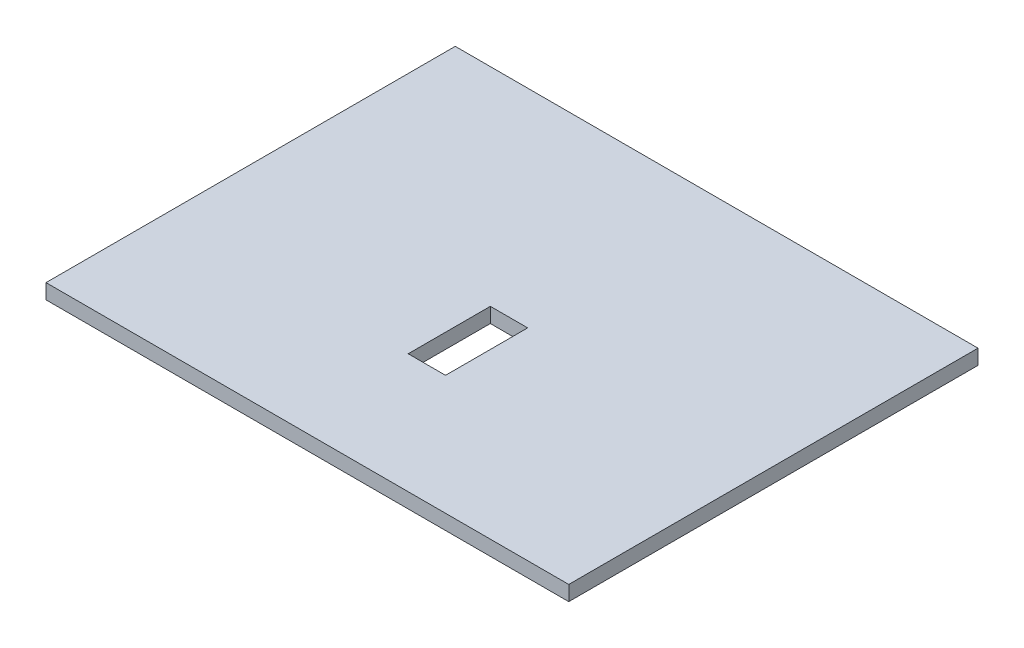
ISO-10303-21;
HEADER;
FILE_DESCRIPTION(('STEP AP214'),'2;1');
FILE_NAME('part.step','',(''),(''),'','','');
FILE_SCHEMA(('AUTOMOTIVE_DESIGN { 1 0 10303 214 1 1 1 1 }'));
ENDSEC;
DATA;
#1=APPLICATION_CONTEXT('core data for automotive mechanical design processes');
#2=APPLICATION_PROTOCOL_DEFINITION('international standard','automotive_design',2000,#1);
#3=PRODUCT_CONTEXT('',#1,'mechanical');
#4=PRODUCT('Part','Part','',(#3));
#5=PRODUCT_RELATED_PRODUCT_CATEGORY('part','',(#4));
#6=PRODUCT_DEFINITION_FORMATION('','',#4);
#7=PRODUCT_DEFINITION_CONTEXT('part definition',#1,'design');
#8=PRODUCT_DEFINITION('design','',#6,#7);
#9=PRODUCT_DEFINITION_SHAPE('','',#8);
#10=(LENGTH_UNIT() NAMED_UNIT(*) SI_UNIT(.MILLI.,.METRE.));
#11=(NAMED_UNIT(*) PLANE_ANGLE_UNIT() SI_UNIT($,.RADIAN.));
#12=(NAMED_UNIT(*) SI_UNIT($,.STERADIAN.) SOLID_ANGLE_UNIT());
#13=UNCERTAINTY_MEASURE_WITH_UNIT(LENGTH_MEASURE(1.E-05),#10,'distance_accuracy_value','');
#14=(GEOMETRIC_REPRESENTATION_CONTEXT(3) GLOBAL_UNCERTAINTY_ASSIGNED_CONTEXT((#13)) GLOBAL_UNIT_ASSIGNED_CONTEXT((#10,
#11,#12)) REPRESENTATION_CONTEXT('',''));
#15=CARTESIAN_POINT('',(0.,0.,0.));
#16=DIRECTION('',(0.,0.,1.));
#17=DIRECTION('',(1.,0.,0.));
#18=AXIS2_PLACEMENT_3D('',#15,#16,#17);
#19=CARTESIAN_POINT('',(175.,10.,175.));
#20=DIRECTION('',(-1.,0.,0.));
#21=DIRECTION('',(0.,0.,1.));
#22=AXIS2_PLACEMENT_3D('',#19,#20,#21);
#23=PLANE('',#22);
#24=DIRECTION('',(0.,0.,-1.));
#25=VECTOR('',#24,1.);
#26=CARTESIAN_POINT('',(175.,10.,175.));
#27=LINE('',#26,#25);
#28=CARTESIAN_POINT('',(175.,10.,99.));
#29=VERTEX_POINT('',#28);
#30=CARTESIAN_POINT('',(175.,10.,-175.));
#31=VERTEX_POINT('',#30);
#32=EDGE_CURVE('E166',#29,#31,#27,.T.);
#33=ORIENTED_EDGE('',*,*,#32,.F.);
#34=DIRECTION('',(0.,1.,0.));
#35=VECTOR('',#34,1.);
#36=CARTESIAN_POINT('',(175.,0.,99.));
#37=LINE('',#36,#35);
#38=CARTESIAN_POINT('',(175.,0.,99.));
#39=VERTEX_POINT('',#38);
#40=EDGE_CURVE('E156',#39,#29,#37,.T.);
#41=ORIENTED_EDGE('',*,*,#40,.F.);
#42=DIRECTION('',(0.,0.,-1.));
#43=VECTOR('',#42,1.);
#44=CARTESIAN_POINT('',(175.,0.,175.));
#45=LINE('',#44,#43);
#46=CARTESIAN_POINT('',(175.,0.,-175.));
#47=VERTEX_POINT('',#46);
#48=EDGE_CURVE('E163',#39,#47,#45,.T.);
#49=ORIENTED_EDGE('',*,*,#48,.T.);
#50=DIRECTION('',(0.,-1.,0.));
#51=VECTOR('',#50,1.);
#52=CARTESIAN_POINT('',(175.,10.,-175.));
#53=LINE('',#52,#51);
#54=EDGE_CURVE('E11',#31,#47,#53,.T.);
#55=ORIENTED_EDGE('',*,*,#54,.F.);
#56=EDGE_LOOP('',(#33,#41,#49,#55));
#57=FACE_BOUND('',#56,.T.);
#58=ADVANCED_FACE('F38',(#57),#23,.F.);
#59=CARTESIAN_POINT('',(-175.,10.,-175.));
#60=DIRECTION('',(0.,0.,1.));
#61=DIRECTION('',(1.,0.,0.));
#62=AXIS2_PLACEMENT_3D('',#59,#60,#61);
#63=PLANE('',#62);
#64=DIRECTION('',(-1.,0.,0.));
#65=VECTOR('',#64,1.);
#66=CARTESIAN_POINT('',(-175.,0.,-175.));
#67=LINE('',#66,#65);
#68=CARTESIAN_POINT('',(-175.,0.,-175.));
#69=VERTEX_POINT('',#68);
#70=EDGE_CURVE('E179',#47,#69,#67,.T.);
#71=ORIENTED_EDGE('',*,*,#70,.T.);
#72=DIRECTION('',(0.,-1.,0.));
#73=VECTOR('',#72,1.);
#74=CARTESIAN_POINT('',(-175.,10.,-175.));
#75=LINE('',#74,#73);
#76=CARTESIAN_POINT('',(-175.,10.,-175.));
#77=VERTEX_POINT('',#76);
#78=EDGE_CURVE('E46',#77,#69,#75,.T.);
#79=ORIENTED_EDGE('',*,*,#78,.F.);
#80=DIRECTION('',(-1.,0.,0.));
#81=VECTOR('',#80,1.);
#82=CARTESIAN_POINT('',(-175.,10.,-175.));
#83=LINE('',#82,#81);
#84=EDGE_CURVE('E169',#31,#77,#83,.T.);
#85=ORIENTED_EDGE('',*,*,#84,.F.);
#86=ORIENTED_EDGE('',*,*,#54,.T.);
#87=EDGE_LOOP('',(#71,#79,#85,#86));
#88=FACE_BOUND('',#87,.T.);
#89=ADVANCED_FACE('F204',(#88),#63,.F.);
#90=CARTESIAN_POINT('',(-175.,10.,175.));
#91=DIRECTION('',(1.,0.,0.));
#92=DIRECTION('',(0.,0.,-1.));
#93=AXIS2_PLACEMENT_3D('',#90,#91,#92);
#94=PLANE('',#93);
#95=DIRECTION('',(0.,0.,1.));
#96=VECTOR('',#95,1.);
#97=CARTESIAN_POINT('',(-175.,0.,175.));
#98=LINE('',#97,#96);
#99=CARTESIAN_POINT('',(-175.,0.,99.));
#100=VERTEX_POINT('',#99);
#101=EDGE_CURVE('E170',#69,#100,#98,.T.);
#102=ORIENTED_EDGE('',*,*,#101,.T.);
#103=DIRECTION('',(0.,1.,0.));
#104=VECTOR('',#103,1.);
#105=CARTESIAN_POINT('',(-175.,0.,99.));
#106=LINE('',#105,#104);
#107=CARTESIAN_POINT('',(-175.,10.,99.));
#108=VERTEX_POINT('',#107);
#109=EDGE_CURVE('E159',#100,#108,#106,.T.);
#110=ORIENTED_EDGE('',*,*,#109,.T.);
#111=DIRECTION('',(0.,0.,1.));
#112=VECTOR('',#111,1.);
#113=CARTESIAN_POINT('',(-175.,10.,175.));
#114=LINE('',#113,#112);
#115=EDGE_CURVE('E173',#77,#108,#114,.T.);
#116=ORIENTED_EDGE('',*,*,#115,.F.);
#117=ORIENTED_EDGE('',*,*,#78,.T.);
#118=EDGE_LOOP('',(#102,#110,#116,#117));
#119=FACE_BOUND('',#118,.T.);
#120=ADVANCED_FACE('F190',(#119),#94,.F.);
#121=CARTESIAN_POINT('',(0.,10.,0.));
#122=DIRECTION('',(0.,-1.,0.));
#123=DIRECTION('',(0.,0.,-1.));
#124=AXIS2_PLACEMENT_3D('',#121,#122,#123);
#125=PLANE('',#124);
#126=DIRECTION('',(-1.,0.,0.));
#127=VECTOR('',#126,1.);
#128=CARTESIAN_POINT('',(-12.5,10.,-36.));
#129=LINE('',#128,#127);
#130=CARTESIAN_POINT('',(12.5,10.,-36.));
#131=VERTEX_POINT('',#130);
#132=CARTESIAN_POINT('',(-12.5,10.,-36.));
#133=VERTEX_POINT('',#132);
#134=EDGE_CURVE('E137',#131,#133,#129,.T.);
#135=ORIENTED_EDGE('',*,*,#134,.F.);
#136=DIRECTION('',(0.,0.,-1.));
#137=VECTOR('',#136,1.);
#138=CARTESIAN_POINT('',(12.5,10.,-36.));
#139=LINE('',#138,#137);
#140=CARTESIAN_POINT('',(12.5,10.,19.));
#141=VERTEX_POINT('',#140);
#142=EDGE_CURVE('E53',#141,#131,#139,.T.);
#143=ORIENTED_EDGE('',*,*,#142,.F.);
#144=DIRECTION('',(1.,0.,0.));
#145=VECTOR('',#144,1.);
#146=CARTESIAN_POINT('',(-12.5,10.,19.));
#147=LINE('',#146,#145);
#148=CARTESIAN_POINT('',(-12.5,10.,19.));
#149=VERTEX_POINT('',#148);
#150=EDGE_CURVE('E124',#149,#141,#147,.T.);
#151=ORIENTED_EDGE('',*,*,#150,.F.);
#152=DIRECTION('',(0.,0.,1.));
#153=VECTOR('',#152,1.);
#154=CARTESIAN_POINT('',(-12.5,10.,-36.));
#155=LINE('',#154,#153);
#156=EDGE_CURVE('E128',#133,#149,#155,.T.);
#157=ORIENTED_EDGE('',*,*,#156,.F.);
#158=EDGE_LOOP('',(#135,#143,#151,#157));
#159=FACE_BOUND('',#158,.T.);
#160=ORIENTED_EDGE('',*,*,#115,.T.);
#161=DIRECTION('',(-1.,0.,0.));
#162=VECTOR('',#161,1.);
#163=CARTESIAN_POINT('',(-175.,10.,99.));
#164=LINE('',#163,#162);
#165=EDGE_CURVE('E146',#29,#108,#164,.T.);
#166=ORIENTED_EDGE('',*,*,#165,.F.);
#167=ORIENTED_EDGE('',*,*,#32,.T.);
#168=ORIENTED_EDGE('',*,*,#84,.T.);
#169=EDGE_LOOP('',(#160,#166,#167,#168));
#170=FACE_BOUND('',#169,.T.);
#171=ADVANCED_FACE('F203',(#159,#170),#125,.F.);
#172=CARTESIAN_POINT('',(0.,0.,0.));
#173=DIRECTION('',(0.,-1.,0.));
#174=DIRECTION('',(0.,0.,-1.));
#175=AXIS2_PLACEMENT_3D('',#172,#173,#174);
#176=PLANE('',#175);
#177=DIRECTION('',(0.,0.,-1.));
#178=VECTOR('',#177,1.);
#179=CARTESIAN_POINT('',(12.5,0.,-36.));
#180=LINE('',#179,#178);
#181=CARTESIAN_POINT('',(12.5,0.,19.));
#182=VERTEX_POINT('',#181);
#183=CARTESIAN_POINT('',(12.5,0.,-36.));
#184=VERTEX_POINT('',#183);
#185=EDGE_CURVE('E105',#182,#184,#180,.T.);
#186=ORIENTED_EDGE('',*,*,#185,.T.);
#187=DIRECTION('',(-1.,0.,0.));
#188=VECTOR('',#187,1.);
#189=CARTESIAN_POINT('',(-12.5,0.,-36.));
#190=LINE('',#189,#188);
#191=CARTESIAN_POINT('',(-12.5,0.,-36.));
#192=VERTEX_POINT('',#191);
#193=EDGE_CURVE('E115',#184,#192,#190,.T.);
#194=ORIENTED_EDGE('',*,*,#193,.T.);
#195=DIRECTION('',(0.,0.,1.));
#196=VECTOR('',#195,1.);
#197=CARTESIAN_POINT('',(-12.5,0.,-36.));
#198=LINE('',#197,#196);
#199=CARTESIAN_POINT('',(-12.5,0.,19.));
#200=VERTEX_POINT('',#199);
#201=EDGE_CURVE('E61',#192,#200,#198,.T.);
#202=ORIENTED_EDGE('',*,*,#201,.T.);
#203=DIRECTION('',(1.,0.,0.));
#204=VECTOR('',#203,1.);
#205=CARTESIAN_POINT('',(-12.5,0.,19.));
#206=LINE('',#205,#204);
#207=EDGE_CURVE('E112',#200,#182,#206,.T.);
#208=ORIENTED_EDGE('',*,*,#207,.T.);
#209=EDGE_LOOP('',(#186,#194,#202,#208));
#210=FACE_BOUND('',#209,.T.);
#211=DIRECTION('',(-1.,0.,0.));
#212=VECTOR('',#211,1.);
#213=CARTESIAN_POINT('',(-175.,0.,99.));
#214=LINE('',#213,#212);
#215=EDGE_CURVE('E152',#39,#100,#214,.T.);
#216=ORIENTED_EDGE('',*,*,#215,.T.);
#217=ORIENTED_EDGE('',*,*,#101,.F.);
#218=ORIENTED_EDGE('',*,*,#70,.F.);
#219=ORIENTED_EDGE('',*,*,#48,.F.);
#220=EDGE_LOOP('',(#216,#217,#218,#219));
#221=FACE_BOUND('',#220,.T.);
#222=ADVANCED_FACE('F120',(#210,#221),#176,.T.);
#223=CARTESIAN_POINT('',(-175.,0.,99.));
#224=DIRECTION('',(0.,0.,-1.));
#225=DIRECTION('',(-1.,0.,0.));
#226=AXIS2_PLACEMENT_3D('',#223,#224,#225);
#227=PLANE('',#226);
#228=ORIENTED_EDGE('',*,*,#165,.T.);
#229=ORIENTED_EDGE('',*,*,#109,.F.);
#230=ORIENTED_EDGE('',*,*,#215,.F.);
#231=ORIENTED_EDGE('',*,*,#40,.T.);
#232=EDGE_LOOP('',(#228,#229,#230,#231));
#233=FACE_BOUND('',#232,.T.);
#234=ADVANCED_FACE('F197',(#233),#227,.F.);
#235=CARTESIAN_POINT('',(12.5,0.,-36.));
#236=DIRECTION('',(1.,0.,0.));
#237=DIRECTION('',(0.,0.,-1.));
#238=AXIS2_PLACEMENT_3D('',#235,#236,#237);
#239=PLANE('',#238);
#240=ORIENTED_EDGE('',*,*,#142,.T.);
#241=DIRECTION('',(0.,1.,0.));
#242=VECTOR('',#241,1.);
#243=CARTESIAN_POINT('',(12.5,0.,-36.));
#244=LINE('',#243,#242);
#245=EDGE_CURVE('E101',#184,#131,#244,.T.);
#246=ORIENTED_EDGE('',*,*,#245,.F.);
#247=ORIENTED_EDGE('',*,*,#185,.F.);
#248=DIRECTION('',(0.,1.,0.));
#249=VECTOR('',#248,1.);
#250=CARTESIAN_POINT('',(12.5,0.,19.));
#251=LINE('',#250,#249);
#252=EDGE_CURVE('E143',#182,#141,#251,.T.);
#253=ORIENTED_EDGE('',*,*,#252,.T.);
#254=EDGE_LOOP('',(#240,#246,#247,#253));
#255=FACE_BOUND('',#254,.T.);
#256=ADVANCED_FACE('F103',(#255),#239,.F.);
#257=CARTESIAN_POINT('',(-12.5,0.,19.));
#258=DIRECTION('',(0.,0.,1.));
#259=DIRECTION('',(1.,0.,0.));
#260=AXIS2_PLACEMENT_3D('',#257,#258,#259);
#261=PLANE('',#260);
#262=ORIENTED_EDGE('',*,*,#150,.T.);
#263=ORIENTED_EDGE('',*,*,#252,.F.);
#264=ORIENTED_EDGE('',*,*,#207,.F.);
#265=DIRECTION('',(0.,1.,0.));
#266=VECTOR('',#265,1.);
#267=CARTESIAN_POINT('',(-12.5,0.,19.));
#268=LINE('',#267,#266);
#269=EDGE_CURVE('E147',#200,#149,#268,.T.);
#270=ORIENTED_EDGE('',*,*,#269,.T.);
#271=EDGE_LOOP('',(#262,#263,#264,#270));
#272=FACE_BOUND('',#271,.T.);
#273=ADVANCED_FACE('F221',(#272),#261,.F.);
#274=CARTESIAN_POINT('',(-12.5,0.,-36.));
#275=DIRECTION('',(-1.,0.,0.));
#276=DIRECTION('',(0.,0.,1.));
#277=AXIS2_PLACEMENT_3D('',#274,#275,#276);
#278=PLANE('',#277);
#279=ORIENTED_EDGE('',*,*,#156,.T.);
#280=ORIENTED_EDGE('',*,*,#269,.F.);
#281=ORIENTED_EDGE('',*,*,#201,.F.);
#282=DIRECTION('',(0.,1.,0.));
#283=VECTOR('',#282,1.);
#284=CARTESIAN_POINT('',(-12.5,0.,-36.));
#285=LINE('',#284,#283);
#286=EDGE_CURVE('E111',#192,#133,#285,.T.);
#287=ORIENTED_EDGE('',*,*,#286,.T.);
#288=EDGE_LOOP('',(#279,#280,#281,#287));
#289=FACE_BOUND('',#288,.T.);
#290=ADVANCED_FACE('F224',(#289),#278,.F.);
#291=CARTESIAN_POINT('',(-12.5,0.,-36.));
#292=DIRECTION('',(0.,0.,-1.));
#293=DIRECTION('',(-1.,0.,0.));
#294=AXIS2_PLACEMENT_3D('',#291,#292,#293);
#295=PLANE('',#294);
#296=ORIENTED_EDGE('',*,*,#134,.T.);
#297=ORIENTED_EDGE('',*,*,#286,.F.);
#298=ORIENTED_EDGE('',*,*,#193,.F.);
#299=ORIENTED_EDGE('',*,*,#245,.T.);
#300=EDGE_LOOP('',(#296,#297,#298,#299));
#301=FACE_BOUND('',#300,.T.);
#302=ADVANCED_FACE('F116',(#301),#295,.F.);
#303=CLOSED_SHELL('',(#58,#89,#120,#171,#222,#234,#256,#273,#290,#302));
#304=MANIFOLD_SOLID_BREP('B2',#303);
#305=ADVANCED_BREP_SHAPE_REPRESENTATION('',(#18,#304),#14);
#306=SHAPE_DEFINITION_REPRESENTATION(#9,#305);
ENDSEC;
END-ISO-10303-21;
